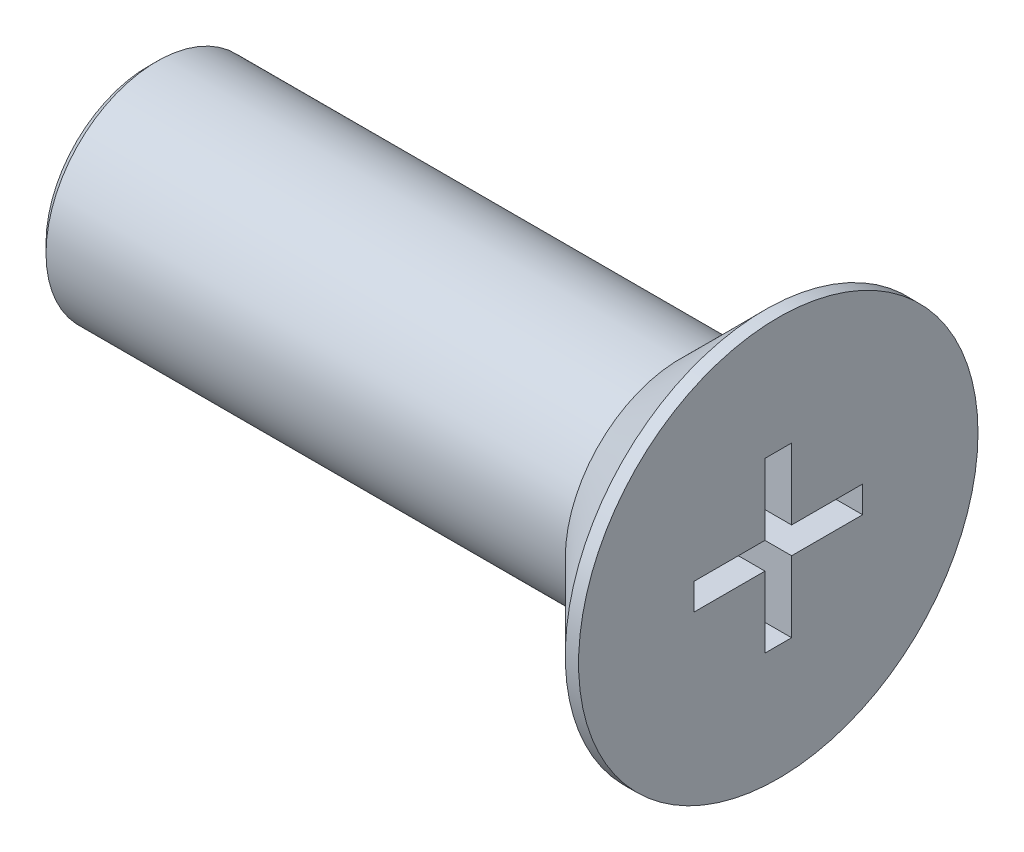
ISO-10303-21;
HEADER;
FILE_DESCRIPTION(('STEP AP214'),'2;1');
FILE_NAME('part.step','',(''),(''),'','','');
FILE_SCHEMA(('AUTOMOTIVE_DESIGN { 1 0 10303 214 1 1 1 1 }'));
ENDSEC;
DATA;
#1=APPLICATION_CONTEXT('core data for automotive mechanical design processes');
#2=APPLICATION_PROTOCOL_DEFINITION('international standard','automotive_design',2000,#1);
#3=PRODUCT_CONTEXT('',#1,'mechanical');
#4=PRODUCT('Part','Part','',(#3));
#5=PRODUCT_RELATED_PRODUCT_CATEGORY('part','',(#4));
#6=PRODUCT_DEFINITION_FORMATION('','',#4);
#7=PRODUCT_DEFINITION_CONTEXT('part definition',#1,'design');
#8=PRODUCT_DEFINITION('design','',#6,#7);
#9=PRODUCT_DEFINITION_SHAPE('','',#8);
#10=(LENGTH_UNIT() NAMED_UNIT(*) SI_UNIT(.MILLI.,.METRE.));
#11=(NAMED_UNIT(*) PLANE_ANGLE_UNIT() SI_UNIT($,.RADIAN.));
#12=(NAMED_UNIT(*) SI_UNIT($,.STERADIAN.) SOLID_ANGLE_UNIT());
#13=UNCERTAINTY_MEASURE_WITH_UNIT(LENGTH_MEASURE(1.E-05),#10,'distance_accuracy_value','');
#14=(GEOMETRIC_REPRESENTATION_CONTEXT(3) GLOBAL_UNCERTAINTY_ASSIGNED_CONTEXT((#13)) GLOBAL_UNIT_ASSIGNED_CONTEXT((#10,
#11,#12)) REPRESENTATION_CONTEXT('',''));
#15=CARTESIAN_POINT('',(0.,0.,0.));
#16=DIRECTION('',(0.,0.,1.));
#17=DIRECTION('',(1.,0.,0.));
#18=AXIS2_PLACEMENT_3D('',#15,#16,#17);
#19=CARTESIAN_POINT('',(0.,0.,0.));
#20=DIRECTION('',(1.,0.,0.));
#21=DIRECTION('',(0.,0.,-1.));
#22=AXIS2_PLACEMENT_3D('',#19,#20,#21);
#23=PLANE('',#22);
#24=CARTESIAN_POINT('',(0.,0.,0.));
#25=DIRECTION('',(1.,0.,0.));
#26=DIRECTION('',(0.,0.,-1.));
#27=AXIS2_PLACEMENT_3D('',#24,#25,#26);
#28=CIRCLE('',#27,2.59999999999999);
#29=CARTESIAN_POINT('',(0.,0.,-2.59999999999999));
#30=VERTEX_POINT('',#29);
#31=EDGE_CURVE('E11',#30,#30,#28,.F.);
#32=ORIENTED_EDGE('',*,*,#31,.T.);
#33=EDGE_LOOP('',(#32));
#34=FACE_BOUND('',#33,.T.);
#35=CARTESIAN_POINT('',(0.,0.,0.));
#36=DIRECTION('',(1.,0.,0.));
#37=DIRECTION('',(0.,0.,-1.));
#38=AXIS2_PLACEMENT_3D('',#35,#36,#37);
#39=CIRCLE('',#38,2.5);
#40=CARTESIAN_POINT('',(0.,0.,-2.5));
#41=VERTEX_POINT('',#40);
#42=EDGE_CURVE('E212',#41,#41,#39,.F.);
#43=ORIENTED_EDGE('',*,*,#42,.F.);
#44=EDGE_LOOP('',(#43));
#45=FACE_BOUND('',#44,.T.);
#46=ADVANCED_FACE('F36',(#34,#45),#23,.F.);
#47=CARTESIAN_POINT('',(2.2,0.,0.));
#48=DIRECTION('',(-1.,0.,0.));
#49=DIRECTION('',(0.,0.,1.));
#50=AXIS2_PLACEMENT_3D('',#47,#48,#49);
#51=CYLINDRICAL_SURFACE('',#50,4.5);
#52=CARTESIAN_POINT('',(1.9,0.,0.));
#53=DIRECTION('',(1.,0.,0.));
#54=DIRECTION('',(0.,0.,-1.));
#55=AXIS2_PLACEMENT_3D('',#52,#53,#54);
#56=CIRCLE('',#55,4.5);
#57=CARTESIAN_POINT('',(1.9,0.,-4.5));
#58=VERTEX_POINT('',#57);
#59=EDGE_CURVE('E44',#58,#58,#56,.T.);
#60=ORIENTED_EDGE('',*,*,#59,.T.);
#61=EDGE_LOOP('',(#60));
#62=FACE_BOUND('',#61,.T.);
#63=CARTESIAN_POINT('',(2.2,0.,0.));
#64=DIRECTION('',(1.,0.,0.));
#65=DIRECTION('',(0.,0.,-1.));
#66=AXIS2_PLACEMENT_3D('',#63,#64,#65);
#67=CIRCLE('',#66,4.5);
#68=CARTESIAN_POINT('',(2.2,0.,-4.5));
#69=VERTEX_POINT('',#68);
#70=EDGE_CURVE('E192',#69,#69,#67,.T.);
#71=ORIENTED_EDGE('',*,*,#70,.F.);
#72=EDGE_LOOP('',(#71));
#73=FACE_BOUND('',#72,.T.);
#74=ADVANCED_FACE('F223',(#62,#73),#51,.T.);
#75=CARTESIAN_POINT('',(2.2,0.,0.));
#76=DIRECTION('',(1.,0.,0.));
#77=DIRECTION('',(0.,0.,-1.));
#78=AXIS2_PLACEMENT_3D('',#75,#76,#77);
#79=PLANE('',#78);
#80=DIRECTION('',(0.,1.,0.));
#81=VECTOR('',#80,1.);
#82=CARTESIAN_POINT('',(2.2,1.9,-0.3));
#83=LINE('',#82,#81);
#84=CARTESIAN_POINT('',(2.2,0.3,-0.3));
#85=VERTEX_POINT('',#84);
#86=CARTESIAN_POINT('',(2.2,1.9,-0.3));
#87=VERTEX_POINT('',#86);
#88=EDGE_CURVE('E51',#85,#87,#83,.T.);
#89=ORIENTED_EDGE('',*,*,#88,.F.);
#90=DIRECTION('',(0.,0.,1.));
#91=VECTOR('',#90,1.);
#92=CARTESIAN_POINT('',(2.2,0.3,-0.3));
#93=LINE('',#92,#91);
#94=CARTESIAN_POINT('',(2.2,0.3,-1.9));
#95=VERTEX_POINT('',#94);
#96=EDGE_CURVE('E188',#95,#85,#93,.T.);
#97=ORIENTED_EDGE('',*,*,#96,.F.);
#98=DIRECTION('',(0.,1.,0.));
#99=VECTOR('',#98,1.);
#100=CARTESIAN_POINT('',(2.2,0.3,-1.9));
#101=LINE('',#100,#99);
#102=CARTESIAN_POINT('',(2.2,-0.3,-1.9));
#103=VERTEX_POINT('',#102);
#104=EDGE_CURVE('E186',#103,#95,#101,.T.);
#105=ORIENTED_EDGE('',*,*,#104,.F.);
#106=DIRECTION('',(0.,0.,-1.));
#107=VECTOR('',#106,1.);
#108=CARTESIAN_POINT('',(2.2,-0.3,-1.9));
#109=LINE('',#108,#107);
#110=CARTESIAN_POINT('',(2.2,-0.3,-0.3));
#111=VERTEX_POINT('',#110);
#112=EDGE_CURVE('E135',#111,#103,#109,.T.);
#113=ORIENTED_EDGE('',*,*,#112,.F.);
#114=DIRECTION('',(0.,1.,0.));
#115=VECTOR('',#114,1.);
#116=CARTESIAN_POINT('',(2.2,-0.3,-0.3));
#117=LINE('',#116,#115);
#118=CARTESIAN_POINT('',(2.2,-1.9,-0.3));
#119=VERTEX_POINT('',#118);
#120=EDGE_CURVE('E182',#119,#111,#117,.T.);
#121=ORIENTED_EDGE('',*,*,#120,.F.);
#122=DIRECTION('',(0.,0.,-1.));
#123=VECTOR('',#122,1.);
#124=CARTESIAN_POINT('',(2.2,-1.9,-0.3));
#125=LINE('',#124,#123);
#126=CARTESIAN_POINT('',(2.2,-1.9,0.3));
#127=VERTEX_POINT('',#126);
#128=EDGE_CURVE('E179',#127,#119,#125,.T.);
#129=ORIENTED_EDGE('',*,*,#128,.F.);
#130=DIRECTION('',(0.,-1.,0.));
#131=VECTOR('',#130,1.);
#132=CARTESIAN_POINT('',(2.2,-1.9,0.3));
#133=LINE('',#132,#131);
#134=CARTESIAN_POINT('',(2.2,-0.3,0.3));
#135=VERTEX_POINT('',#134);
#136=EDGE_CURVE('E176',#135,#127,#133,.T.);
#137=ORIENTED_EDGE('',*,*,#136,.F.);
#138=DIRECTION('',(0.,0.,-1.));
#139=VECTOR('',#138,1.);
#140=CARTESIAN_POINT('',(2.2,-0.3,0.3));
#141=LINE('',#140,#139);
#142=CARTESIAN_POINT('',(2.2,-0.3,1.9));
#143=VERTEX_POINT('',#142);
#144=EDGE_CURVE('E173',#143,#135,#141,.T.);
#145=ORIENTED_EDGE('',*,*,#144,.F.);
#146=DIRECTION('',(0.,-1.,0.));
#147=VECTOR('',#146,1.);
#148=CARTESIAN_POINT('',(2.2,-0.3,1.9));
#149=LINE('',#148,#147);
#150=CARTESIAN_POINT('',(2.2,0.3,1.9));
#151=VERTEX_POINT('',#150);
#152=EDGE_CURVE('E170',#151,#143,#149,.T.);
#153=ORIENTED_EDGE('',*,*,#152,.F.);
#154=DIRECTION('',(0.,0.,1.));
#155=VECTOR('',#154,1.);
#156=CARTESIAN_POINT('',(2.2,0.3,1.9));
#157=LINE('',#156,#155);
#158=CARTESIAN_POINT('',(2.2,0.3,0.3));
#159=VERTEX_POINT('',#158);
#160=EDGE_CURVE('E167',#159,#151,#157,.T.);
#161=ORIENTED_EDGE('',*,*,#160,.F.);
#162=DIRECTION('',(0.,-1.,0.));
#163=VECTOR('',#162,1.);
#164=CARTESIAN_POINT('',(2.2,0.3,0.3));
#165=LINE('',#164,#163);
#166=CARTESIAN_POINT('',(2.2,1.9,0.3));
#167=VERTEX_POINT('',#166);
#168=EDGE_CURVE('E164',#167,#159,#165,.T.);
#169=ORIENTED_EDGE('',*,*,#168,.F.);
#170=DIRECTION('',(0.,0.,1.));
#171=VECTOR('',#170,1.);
#172=CARTESIAN_POINT('',(2.2,1.9,0.3));
#173=LINE('',#172,#171);
#174=EDGE_CURVE('E161',#87,#167,#173,.T.);
#175=ORIENTED_EDGE('',*,*,#174,.F.);
#176=EDGE_LOOP('',(#89,#97,#105,#113,#121,#129,#137,#145,#153,#161,#169,#175));
#177=FACE_BOUND('',#176,.T.);
#178=ORIENTED_EDGE('',*,*,#70,.T.);
#179=EDGE_LOOP('',(#178));
#180=FACE_BOUND('',#179,.T.);
#181=ADVANCED_FACE('F245',(#177,#180),#79,.T.);
#182=CARTESIAN_POINT('',(-12.,0.,0.));
#183=DIRECTION('',(1.,0.,0.));
#184=DIRECTION('',(0.,0.,-1.));
#185=AXIS2_PLACEMENT_3D('',#182,#183,#184);
#186=CYLINDRICAL_SURFACE('',#185,2.5);
#187=CARTESIAN_POINT('',(-11.8,0.,0.));
#188=DIRECTION('',(-1.,0.,0.));
#189=DIRECTION('',(0.,0.,1.));
#190=AXIS2_PLACEMENT_3D('',#187,#188,#189);
#191=CIRCLE('',#190,2.5);
#192=CARTESIAN_POINT('',(-11.8,0.,2.5));
#193=VERTEX_POINT('',#192);
#194=EDGE_CURVE('E218',#193,#193,#191,.F.);
#195=ORIENTED_EDGE('',*,*,#194,.T.);
#196=EDGE_LOOP('',(#195));
#197=FACE_BOUND('',#196,.T.);
#198=ORIENTED_EDGE('',*,*,#42,.T.);
#199=EDGE_LOOP('',(#198));
#200=FACE_BOUND('',#199,.T.);
#201=ADVANCED_FACE('F251',(#197,#200),#186,.T.);
#202=CARTESIAN_POINT('',(-12.,0.,0.));
#203=DIRECTION('',(-1.,0.,0.));
#204=DIRECTION('',(0.,0.,1.));
#205=AXIS2_PLACEMENT_3D('',#202,#203,#204);
#206=PLANE('',#205);
#207=CARTESIAN_POINT('',(-12.,0.,0.));
#208=DIRECTION('',(-1.,0.,0.));
#209=DIRECTION('',(0.,0.,1.));
#210=AXIS2_PLACEMENT_3D('',#207,#208,#209);
#211=CIRCLE('',#210,2.3);
#212=CARTESIAN_POINT('',(-12.,0.,2.3));
#213=VERTEX_POINT('',#212);
#214=EDGE_CURVE('E215',#213,#213,#211,.T.);
#215=ORIENTED_EDGE('',*,*,#214,.T.);
#216=EDGE_LOOP('',(#215));
#217=FACE_BOUND('',#216,.T.);
#218=ADVANCED_FACE('F236',(#217),#206,.T.);
#219=CARTESIAN_POINT('',(-12.,0.,0.));
#220=DIRECTION('',(1.,0.,0.));
#221=DIRECTION('',(0.,0.,-1.));
#222=AXIS2_PLACEMENT_3D('',#219,#220,#221);
#223=CONICAL_SURFACE('',#222,2.3,0.785398163397447);
#224=ORIENTED_EDGE('',*,*,#194,.F.);
#225=EDGE_LOOP('',(#224));
#226=FACE_BOUND('',#225,.T.);
#227=ORIENTED_EDGE('',*,*,#214,.F.);
#228=EDGE_LOOP('',(#227));
#229=FACE_BOUND('',#228,.T.);
#230=ADVANCED_FACE('F228',(#226,#229),#223,.T.);
#231=CARTESIAN_POINT('',(1.9,0.,0.));
#232=DIRECTION('',(1.,0.,0.));
#233=DIRECTION('',(0.,0.,-1.));
#234=AXIS2_PLACEMENT_3D('',#231,#232,#233);
#235=CONICAL_SURFACE('',#234,4.5,0.78539816339745);
#236=ORIENTED_EDGE('',*,*,#31,.F.);
#237=EDGE_LOOP('',(#236));
#238=FACE_BOUND('',#237,.T.);
#239=ORIENTED_EDGE('',*,*,#59,.F.);
#240=EDGE_LOOP('',(#239));
#241=FACE_BOUND('',#240,.T.);
#242=ADVANCED_FACE('F38',(#238,#241),#235,.T.);
#243=CARTESIAN_POINT('',(-0.8,1.9,-0.3));
#244=DIRECTION('',(0.,0.,-1.));
#245=DIRECTION('',(0.,1.,0.));
#246=AXIS2_PLACEMENT_3D('',#243,#244,#245);
#247=PLANE('',#246);
#248=ORIENTED_EDGE('',*,*,#88,.T.);
#249=DIRECTION('',(1.,0.,0.));
#250=VECTOR('',#249,1.);
#251=CARTESIAN_POINT('',(-0.8,1.9,-0.3));
#252=LINE('',#251,#250);
#253=CARTESIAN_POINT('',(-0.8,1.9,-0.3));
#254=VERTEX_POINT('',#253);
#255=EDGE_CURVE('E99',#254,#87,#252,.T.);
#256=ORIENTED_EDGE('',*,*,#255,.F.);
#257=DIRECTION('',(0.,1.,0.));
#258=VECTOR('',#257,1.);
#259=CARTESIAN_POINT('',(-0.8,1.9,-0.3));
#260=LINE('',#259,#258);
#261=CARTESIAN_POINT('',(-0.8,0.3,-0.3));
#262=VERTEX_POINT('',#261);
#263=EDGE_CURVE('E190',#262,#254,#260,.T.);
#264=ORIENTED_EDGE('',*,*,#263,.F.);
#265=DIRECTION('',(1.,0.,0.));
#266=VECTOR('',#265,1.);
#267=CARTESIAN_POINT('',(-0.8,0.3,-0.3));
#268=LINE('',#267,#266);
#269=EDGE_CURVE('E59',#262,#85,#268,.T.);
#270=ORIENTED_EDGE('',*,*,#269,.T.);
#271=EDGE_LOOP('',(#248,#256,#264,#270));
#272=FACE_BOUND('',#271,.T.);
#273=ADVANCED_FACE('F227',(#272),#247,.F.);
#274=CARTESIAN_POINT('',(-0.8,0.3,-0.3));
#275=DIRECTION('',(0.,1.,0.));
#276=DIRECTION('',(0.,0.,1.));
#277=AXIS2_PLACEMENT_3D('',#274,#275,#276);
#278=PLANE('',#277);
#279=ORIENTED_EDGE('',*,*,#96,.T.);
#280=ORIENTED_EDGE('',*,*,#269,.F.);
#281=DIRECTION('',(0.,0.,1.));
#282=VECTOR('',#281,1.);
#283=CARTESIAN_POINT('',(-0.8,0.3,-0.3));
#284=LINE('',#283,#282);
#285=CARTESIAN_POINT('',(-0.8,0.3,-1.9));
#286=VERTEX_POINT('',#285);
#287=EDGE_CURVE('E147',#286,#262,#284,.T.);
#288=ORIENTED_EDGE('',*,*,#287,.F.);
#289=DIRECTION('',(1.,0.,0.));
#290=VECTOR('',#289,1.);
#291=CARTESIAN_POINT('',(-0.8,0.3,-1.9));
#292=LINE('',#291,#290);
#293=EDGE_CURVE('E139',#286,#95,#292,.T.);
#294=ORIENTED_EDGE('',*,*,#293,.T.);
#295=EDGE_LOOP('',(#279,#280,#288,#294));
#296=FACE_BOUND('',#295,.T.);
#297=ADVANCED_FACE('F234',(#296),#278,.F.);
#298=CARTESIAN_POINT('',(-0.8,0.3,-1.9));
#299=DIRECTION('',(0.,0.,-1.));
#300=DIRECTION('',(-1.,0.,0.));
#301=AXIS2_PLACEMENT_3D('',#298,#299,#300);
#302=PLANE('',#301);
#303=ORIENTED_EDGE('',*,*,#104,.T.);
#304=ORIENTED_EDGE('',*,*,#293,.F.);
#305=DIRECTION('',(0.,1.,0.));
#306=VECTOR('',#305,1.);
#307=CARTESIAN_POINT('',(-0.8,0.3,-1.9));
#308=LINE('',#307,#306);
#309=CARTESIAN_POINT('',(-0.8,-0.3,-1.9));
#310=VERTEX_POINT('',#309);
#311=EDGE_CURVE('E143',#310,#286,#308,.T.);
#312=ORIENTED_EDGE('',*,*,#311,.F.);
#313=DIRECTION('',(1.,0.,0.));
#314=VECTOR('',#313,1.);
#315=CARTESIAN_POINT('',(-0.8,-0.3,-1.9));
#316=LINE('',#315,#314);
#317=EDGE_CURVE('E128',#310,#103,#316,.T.);
#318=ORIENTED_EDGE('',*,*,#317,.T.);
#319=EDGE_LOOP('',(#303,#304,#312,#318));
#320=FACE_BOUND('',#319,.T.);
#321=ADVANCED_FACE('F144',(#320),#302,.F.);
#322=CARTESIAN_POINT('',(-0.8,-0.3,-1.9));
#323=DIRECTION('',(0.,-1.,0.));
#324=DIRECTION('',(0.,0.,-1.));
#325=AXIS2_PLACEMENT_3D('',#322,#323,#324);
#326=PLANE('',#325);
#327=ORIENTED_EDGE('',*,*,#112,.T.);
#328=ORIENTED_EDGE('',*,*,#317,.F.);
#329=DIRECTION('',(0.,0.,-1.));
#330=VECTOR('',#329,1.);
#331=CARTESIAN_POINT('',(-0.8,-0.3,-1.9));
#332=LINE('',#331,#330);
#333=CARTESIAN_POINT('',(-0.8,-0.3,-0.3));
#334=VERTEX_POINT('',#333);
#335=EDGE_CURVE('E132',#334,#310,#332,.T.);
#336=ORIENTED_EDGE('',*,*,#335,.F.);
#337=DIRECTION('',(1.,0.,0.));
#338=VECTOR('',#337,1.);
#339=CARTESIAN_POINT('',(-0.8,-0.3,-0.3));
#340=LINE('',#339,#338);
#341=EDGE_CURVE('E140',#334,#111,#340,.T.);
#342=ORIENTED_EDGE('',*,*,#341,.T.);
#343=EDGE_LOOP('',(#327,#328,#336,#342));
#344=FACE_BOUND('',#343,.T.);
#345=ADVANCED_FACE('F130',(#344),#326,.F.);
#346=CARTESIAN_POINT('',(-0.8,-0.3,-0.3));
#347=DIRECTION('',(0.,0.,-1.));
#348=DIRECTION('',(0.,1.,0.));
#349=AXIS2_PLACEMENT_3D('',#346,#347,#348);
#350=PLANE('',#349);
#351=ORIENTED_EDGE('',*,*,#120,.T.);
#352=ORIENTED_EDGE('',*,*,#341,.F.);
#353=DIRECTION('',(0.,1.,0.));
#354=VECTOR('',#353,1.);
#355=CARTESIAN_POINT('',(-0.8,-0.3,-0.3));
#356=LINE('',#355,#354);
#357=CARTESIAN_POINT('',(-0.8,-1.9,-0.3));
#358=VERTEX_POINT('',#357);
#359=EDGE_CURVE('E153',#358,#334,#356,.T.);
#360=ORIENTED_EDGE('',*,*,#359,.F.);
#361=DIRECTION('',(1.,0.,0.));
#362=VECTOR('',#361,1.);
#363=CARTESIAN_POINT('',(-0.8,-1.9,-0.3));
#364=LINE('',#363,#362);
#365=EDGE_CURVE('E195',#358,#119,#364,.T.);
#366=ORIENTED_EDGE('',*,*,#365,.T.);
#367=EDGE_LOOP('',(#351,#352,#360,#366));
#368=FACE_BOUND('',#367,.T.);
#369=ADVANCED_FACE('F286',(#368),#350,.F.);
#370=CARTESIAN_POINT('',(-0.8,-1.9,-0.3));
#371=DIRECTION('',(0.,-1.,0.));
#372=DIRECTION('',(0.,0.,-1.));
#373=AXIS2_PLACEMENT_3D('',#370,#371,#372);
#374=PLANE('',#373);
#375=ORIENTED_EDGE('',*,*,#128,.T.);
#376=ORIENTED_EDGE('',*,*,#365,.F.);
#377=DIRECTION('',(0.,0.,-1.));
#378=VECTOR('',#377,1.);
#379=CARTESIAN_POINT('',(-0.8,-1.9,-0.3));
#380=LINE('',#379,#378);
#381=CARTESIAN_POINT('',(-0.8,-1.9,0.3));
#382=VERTEX_POINT('',#381);
#383=EDGE_CURVE('E155',#382,#358,#380,.T.);
#384=ORIENTED_EDGE('',*,*,#383,.F.);
#385=DIRECTION('',(1.,0.,0.));
#386=VECTOR('',#385,1.);
#387=CARTESIAN_POINT('',(-0.8,-1.9,0.3));
#388=LINE('',#387,#386);
#389=EDGE_CURVE('E197',#382,#127,#388,.T.);
#390=ORIENTED_EDGE('',*,*,#389,.T.);
#391=EDGE_LOOP('',(#375,#376,#384,#390));
#392=FACE_BOUND('',#391,.T.);
#393=ADVANCED_FACE('F282',(#392),#374,.F.);
#394=CARTESIAN_POINT('',(-0.8,-1.9,0.3));
#395=DIRECTION('',(0.,0.,1.));
#396=DIRECTION('',(0.,-1.,0.));
#397=AXIS2_PLACEMENT_3D('',#394,#395,#396);
#398=PLANE('',#397);
#399=ORIENTED_EDGE('',*,*,#136,.T.);
#400=ORIENTED_EDGE('',*,*,#389,.F.);
#401=DIRECTION('',(0.,-1.,0.));
#402=VECTOR('',#401,1.);
#403=CARTESIAN_POINT('',(-0.8,-1.9,0.3));
#404=LINE('',#403,#402);
#405=CARTESIAN_POINT('',(-0.8,-0.3,0.3));
#406=VERTEX_POINT('',#405);
#407=EDGE_CURVE('E441',#406,#382,#404,.T.);
#408=ORIENTED_EDGE('',*,*,#407,.F.);
#409=DIRECTION('',(1.,0.,0.));
#410=VECTOR('',#409,1.);
#411=CARTESIAN_POINT('',(-0.8,-0.3,0.3));
#412=LINE('',#411,#410);
#413=EDGE_CURVE('E199',#406,#135,#412,.T.);
#414=ORIENTED_EDGE('',*,*,#413,.T.);
#415=EDGE_LOOP('',(#399,#400,#408,#414));
#416=FACE_BOUND('',#415,.T.);
#417=ADVANCED_FACE('F278',(#416),#398,.F.);
#418=CARTESIAN_POINT('',(-0.8,-0.3,0.3));
#419=DIRECTION('',(0.,-1.,0.));
#420=DIRECTION('',(0.,0.,-1.));
#421=AXIS2_PLACEMENT_3D('',#418,#419,#420);
#422=PLANE('',#421);
#423=ORIENTED_EDGE('',*,*,#144,.T.);
#424=ORIENTED_EDGE('',*,*,#413,.F.);
#425=DIRECTION('',(0.,0.,-1.));
#426=VECTOR('',#425,1.);
#427=CARTESIAN_POINT('',(-0.8,-0.3,0.3));
#428=LINE('',#427,#426);
#429=CARTESIAN_POINT('',(-0.8,-0.3,1.9));
#430=VERTEX_POINT('',#429);
#431=EDGE_CURVE('E438',#430,#406,#428,.T.);
#432=ORIENTED_EDGE('',*,*,#431,.F.);
#433=DIRECTION('',(1.,0.,0.));
#434=VECTOR('',#433,1.);
#435=CARTESIAN_POINT('',(-0.8,-0.3,1.9));
#436=LINE('',#435,#434);
#437=EDGE_CURVE('E201',#430,#143,#436,.T.);
#438=ORIENTED_EDGE('',*,*,#437,.T.);
#439=EDGE_LOOP('',(#423,#424,#432,#438));
#440=FACE_BOUND('',#439,.T.);
#441=ADVANCED_FACE('F274',(#440),#422,.F.);
#442=CARTESIAN_POINT('',(-0.8,-0.3,1.9));
#443=DIRECTION('',(0.,0.,1.));
#444=DIRECTION('',(1.,0.,0.));
#445=AXIS2_PLACEMENT_3D('',#442,#443,#444);
#446=PLANE('',#445);
#447=ORIENTED_EDGE('',*,*,#152,.T.);
#448=ORIENTED_EDGE('',*,*,#437,.F.);
#449=DIRECTION('',(0.,-1.,0.));
#450=VECTOR('',#449,1.);
#451=CARTESIAN_POINT('',(-0.8,-0.3,1.9));
#452=LINE('',#451,#450);
#453=CARTESIAN_POINT('',(-0.8,0.3,1.9));
#454=VERTEX_POINT('',#453);
#455=EDGE_CURVE('E435',#454,#430,#452,.T.);
#456=ORIENTED_EDGE('',*,*,#455,.F.);
#457=DIRECTION('',(1.,0.,0.));
#458=VECTOR('',#457,1.);
#459=CARTESIAN_POINT('',(-0.8,0.3,1.9));
#460=LINE('',#459,#458);
#461=EDGE_CURVE('E203',#454,#151,#460,.T.);
#462=ORIENTED_EDGE('',*,*,#461,.T.);
#463=EDGE_LOOP('',(#447,#448,#456,#462));
#464=FACE_BOUND('',#463,.T.);
#465=ADVANCED_FACE('F270',(#464),#446,.F.);
#466=CARTESIAN_POINT('',(-0.8,0.3,1.9));
#467=DIRECTION('',(0.,1.,0.));
#468=DIRECTION('',(0.,0.,1.));
#469=AXIS2_PLACEMENT_3D('',#466,#467,#468);
#470=PLANE('',#469);
#471=ORIENTED_EDGE('',*,*,#160,.T.);
#472=ORIENTED_EDGE('',*,*,#461,.F.);
#473=DIRECTION('',(0.,0.,1.));
#474=VECTOR('',#473,1.);
#475=CARTESIAN_POINT('',(-0.8,0.3,1.9));
#476=LINE('',#475,#474);
#477=CARTESIAN_POINT('',(-0.8,0.3,0.3));
#478=VERTEX_POINT('',#477);
#479=EDGE_CURVE('E432',#478,#454,#476,.T.);
#480=ORIENTED_EDGE('',*,*,#479,.F.);
#481=DIRECTION('',(1.,0.,0.));
#482=VECTOR('',#481,1.);
#483=CARTESIAN_POINT('',(-0.8,0.3,0.3));
#484=LINE('',#483,#482);
#485=EDGE_CURVE('E205',#478,#159,#484,.T.);
#486=ORIENTED_EDGE('',*,*,#485,.T.);
#487=EDGE_LOOP('',(#471,#472,#480,#486));
#488=FACE_BOUND('',#487,.T.);
#489=ADVANCED_FACE('F266',(#488),#470,.F.);
#490=CARTESIAN_POINT('',(-0.8,0.3,0.3));
#491=DIRECTION('',(0.,0.,1.));
#492=DIRECTION('',(0.,-1.,0.));
#493=AXIS2_PLACEMENT_3D('',#490,#491,#492);
#494=PLANE('',#493);
#495=ORIENTED_EDGE('',*,*,#168,.T.);
#496=ORIENTED_EDGE('',*,*,#485,.F.);
#497=DIRECTION('',(0.,-1.,0.));
#498=VECTOR('',#497,1.);
#499=CARTESIAN_POINT('',(-0.8,0.3,0.3));
#500=LINE('',#499,#498);
#501=CARTESIAN_POINT('',(-0.8,1.9,0.3));
#502=VERTEX_POINT('',#501);
#503=EDGE_CURVE('E427',#502,#478,#500,.T.);
#504=ORIENTED_EDGE('',*,*,#503,.F.);
#505=DIRECTION('',(1.,0.,0.));
#506=VECTOR('',#505,1.);
#507=CARTESIAN_POINT('',(-0.8,1.9,0.3));
#508=LINE('',#507,#506);
#509=EDGE_CURVE('E207',#502,#167,#508,.T.);
#510=ORIENTED_EDGE('',*,*,#509,.T.);
#511=EDGE_LOOP('',(#495,#496,#504,#510));
#512=FACE_BOUND('',#511,.T.);
#513=ADVANCED_FACE('F262',(#512),#494,.F.);
#514=CARTESIAN_POINT('',(-0.8,1.9,0.3));
#515=DIRECTION('',(0.,1.,0.));
#516=DIRECTION('',(0.,0.,1.));
#517=AXIS2_PLACEMENT_3D('',#514,#515,#516);
#518=PLANE('',#517);
#519=ORIENTED_EDGE('',*,*,#174,.T.);
#520=ORIENTED_EDGE('',*,*,#509,.F.);
#521=DIRECTION('',(0.,0.,1.));
#522=VECTOR('',#521,1.);
#523=CARTESIAN_POINT('',(-0.8,1.9,0.3));
#524=LINE('',#523,#522);
#525=EDGE_CURVE('E425',#254,#502,#524,.T.);
#526=ORIENTED_EDGE('',*,*,#525,.F.);
#527=ORIENTED_EDGE('',*,*,#255,.T.);
#528=EDGE_LOOP('',(#519,#520,#526,#527));
#529=FACE_BOUND('',#528,.T.);
#530=ADVANCED_FACE('F259',(#529),#518,.F.);
#531=CARTESIAN_POINT('',(-0.8,0.,0.));
#532=DIRECTION('',(1.,0.,0.));
#533=DIRECTION('',(0.,0.,-1.));
#534=AXIS2_PLACEMENT_3D('',#531,#532,#533);
#535=PLANE('',#534);
#536=ORIENTED_EDGE('',*,*,#263,.T.);
#537=ORIENTED_EDGE('',*,*,#525,.T.);
#538=ORIENTED_EDGE('',*,*,#503,.T.);
#539=ORIENTED_EDGE('',*,*,#479,.T.);
#540=ORIENTED_EDGE('',*,*,#455,.T.);
#541=ORIENTED_EDGE('',*,*,#431,.T.);
#542=ORIENTED_EDGE('',*,*,#407,.T.);
#543=ORIENTED_EDGE('',*,*,#383,.T.);
#544=ORIENTED_EDGE('',*,*,#359,.T.);
#545=ORIENTED_EDGE('',*,*,#335,.T.);
#546=ORIENTED_EDGE('',*,*,#311,.T.);
#547=ORIENTED_EDGE('',*,*,#287,.T.);
#548=EDGE_LOOP('',(#536,#537,#538,#539,#540,#541,#542,#543,#544,#545,#546,#547));
#549=FACE_BOUND('',#548,.T.);
#550=ADVANCED_FACE('F150',(#549),#535,.T.);
#551=CLOSED_SHELL('',(#46,#74,#181,#201,#218,#230,#242,#273,#297,#321,#345,#369,#393,#417,#441,
#465,#489,#513,#530,#550));
#552=MANIFOLD_SOLID_BREP('B2',#551);
#553=ADVANCED_BREP_SHAPE_REPRESENTATION('',(#18,#552),#14);
#554=SHAPE_DEFINITION_REPRESENTATION(#9,#553);
ENDSEC;
END-ISO-10303-21;
